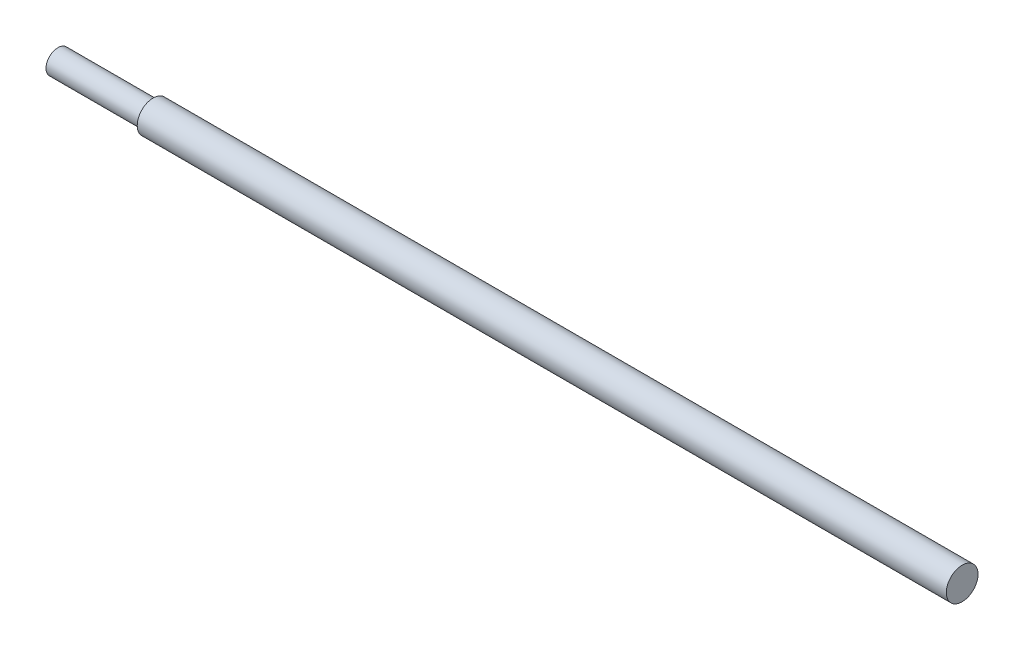
ISO-10303-21;
HEADER;
FILE_DESCRIPTION(('STEP AP214'),'2;1');
FILE_NAME('part.step','',(''),(''),'','','');
FILE_SCHEMA(('AUTOMOTIVE_DESIGN { 1 0 10303 214 1 1 1 1 }'));
ENDSEC;
DATA;
#1=APPLICATION_CONTEXT('core data for automotive mechanical design processes');
#2=APPLICATION_PROTOCOL_DEFINITION('international standard','automotive_design',2000,#1);
#3=PRODUCT_CONTEXT('',#1,'mechanical');
#4=PRODUCT('Part','Part','',(#3));
#5=PRODUCT_RELATED_PRODUCT_CATEGORY('part','',(#4));
#6=PRODUCT_DEFINITION_FORMATION('','',#4);
#7=PRODUCT_DEFINITION_CONTEXT('part definition',#1,'design');
#8=PRODUCT_DEFINITION('design','',#6,#7);
#9=PRODUCT_DEFINITION_SHAPE('','',#8);
#10=(LENGTH_UNIT() NAMED_UNIT(*) SI_UNIT(.MILLI.,.METRE.));
#11=(NAMED_UNIT(*) PLANE_ANGLE_UNIT() SI_UNIT($,.RADIAN.));
#12=(NAMED_UNIT(*) SI_UNIT($,.STERADIAN.) SOLID_ANGLE_UNIT());
#13=UNCERTAINTY_MEASURE_WITH_UNIT(LENGTH_MEASURE(1.E-05),#10,'distance_accuracy_value','');
#14=(GEOMETRIC_REPRESENTATION_CONTEXT(3) GLOBAL_UNCERTAINTY_ASSIGNED_CONTEXT((#13)) GLOBAL_UNIT_ASSIGNED_CONTEXT((#10,
#11,#12)) REPRESENTATION_CONTEXT('',''));
#15=CARTESIAN_POINT('',(0.,0.,0.));
#16=DIRECTION('',(0.,0.,1.));
#17=DIRECTION('',(1.,0.,0.));
#18=AXIS2_PLACEMENT_3D('',#15,#16,#17);
#19=CARTESIAN_POINT('',(1.11022302462518E-13,0.,0.));
#20=DIRECTION('',(1.,0.,0.));
#21=DIRECTION('',(0.,0.,-1.));
#22=AXIS2_PLACEMENT_3D('',#19,#20,#21);
#23=PLANE('',#22);
#24=CARTESIAN_POINT('',(1.11022302462516E-13,0.,0.));
#25=DIRECTION('',(-1.,0.,0.));
#26=DIRECTION('',(0.,0.,1.));
#27=AXIS2_PLACEMENT_3D('',#24,#25,#26);
#28=CIRCLE('',#27,12.7);
#29=CARTESIAN_POINT('',(1.12577603897433E-13,0.,12.6999999999999));
#30=VERTEX_POINT('',#29);
#31=EDGE_CURVE('E71',#30,#30,#28,.T.);
#32=ORIENTED_EDGE('',*,*,#31,.F.);
#33=EDGE_LOOP('',(#32));
#34=FACE_BOUND('',#33,.T.);
#35=ADVANCED_FACE('F39',(#34),#23,.T.);
#36=CARTESIAN_POINT('',(-723.9,0.,0.));
#37=DIRECTION('',(-1.,0.,0.));
#38=DIRECTION('',(0.,0.,1.));
#39=AXIS2_PLACEMENT_3D('',#36,#37,#38);
#40=CYLINDRICAL_SURFACE('',#39,12.7);
#41=CARTESIAN_POINT('',(-424.18,0.,0.));
#42=DIRECTION('',(-1.,0.,0.));
#43=DIRECTION('',(0.,0.,1.));
#44=AXIS2_PLACEMENT_3D('',#41,#42,#43);
#45=CIRCLE('',#44,12.7);
#46=CARTESIAN_POINT('',(-424.18,-8.40026041262992,-9.52500000000016));
#47=VERTEX_POINT('',#46);
#48=CARTESIAN_POINT('',(-424.18,8.40026041262992,-9.52500000000016));
#49=VERTEX_POINT('',#48);
#50=EDGE_CURVE('E66',#47,#49,#45,.F.);
#51=ORIENTED_EDGE('',*,*,#50,.F.);
#52=DIRECTION('',(-1.,0.,0.));
#53=VECTOR('',#52,1.);
#54=CARTESIAN_POINT('',(-723.9,-8.40026041262988,-9.52500000000016));
#55=LINE('',#54,#53);
#56=CARTESIAN_POINT('',(-398.78,-8.40026041262988,-9.52500000000016));
#57=VERTEX_POINT('',#56);
#58=EDGE_CURVE('E11',#57,#47,#55,.T.);
#59=ORIENTED_EDGE('',*,*,#58,.F.);
#60=CARTESIAN_POINT('',(-398.78,0.,0.));
#61=DIRECTION('',(1.,0.,0.));
#62=DIRECTION('',(0.,0.,-1.));
#63=AXIS2_PLACEMENT_3D('',#60,#61,#62);
#64=CIRCLE('',#63,12.7);
#65=CARTESIAN_POINT('',(-398.78,8.40026041262988,-9.52500000000016));
#66=VERTEX_POINT('',#65);
#67=EDGE_CURVE('E46',#66,#57,#64,.F.);
#68=ORIENTED_EDGE('',*,*,#67,.F.);
#69=DIRECTION('',(-1.,0.,0.));
#70=VECTOR('',#69,1.);
#71=CARTESIAN_POINT('',(-723.9,8.40026041262988,-9.52500000000016));
#72=LINE('',#71,#70);
#73=EDGE_CURVE('E53',#49,#66,#72,.F.);
#74=ORIENTED_EDGE('',*,*,#73,.F.);
#75=EDGE_LOOP('',(#51,#59,#68,#74));
#76=FACE_BOUND('',#75,.T.);
#77=ORIENTED_EDGE('',*,*,#31,.T.);
#78=EDGE_LOOP('',(#77));
#79=FACE_BOUND('',#78,.T.);
#80=CARTESIAN_POINT('',(-647.7,0.,0.));
#81=DIRECTION('',(-1.,0.,0.));
#82=DIRECTION('',(0.,0.,1.));
#83=AXIS2_PLACEMENT_3D('',#80,#81,#82);
#84=CIRCLE('',#83,12.7);
#85=CARTESIAN_POINT('',(-647.7,0.,12.7));
#86=VERTEX_POINT('',#85);
#87=EDGE_CURVE('E86',#86,#86,#84,.T.);
#88=ORIENTED_EDGE('',*,*,#87,.F.);
#89=EDGE_LOOP('',(#88));
#90=FACE_BOUND('',#89,.T.);
#91=ADVANCED_FACE('F67',(#76,#79,#90),#40,.T.);
#92=CARTESIAN_POINT('',(-647.7,0.,0.));
#93=DIRECTION('',(-1.,0.,0.));
#94=DIRECTION('',(0.,0.,1.));
#95=AXIS2_PLACEMENT_3D('',#92,#93,#94);
#96=PLANE('',#95);
#97=ORIENTED_EDGE('',*,*,#87,.T.);
#98=EDGE_LOOP('',(#97));
#99=FACE_BOUND('',#98,.T.);
#100=CARTESIAN_POINT('',(-647.7,0.,0.));
#101=DIRECTION('',(-1.,0.,0.));
#102=DIRECTION('',(0.,0.,1.));
#103=AXIS2_PLACEMENT_3D('',#100,#101,#102);
#104=CIRCLE('',#103,9.52499999999999);
#105=CARTESIAN_POINT('',(-647.7,0.,9.52499999999998));
#106=VERTEX_POINT('',#105);
#107=EDGE_CURVE('E83',#106,#106,#104,.T.);
#108=ORIENTED_EDGE('',*,*,#107,.F.);
#109=EDGE_LOOP('',(#108));
#110=FACE_BOUND('',#109,.T.);
#111=ADVANCED_FACE('F98',(#99,#110),#96,.T.);
#112=CARTESIAN_POINT('',(-723.9,0.,0.));
#113=DIRECTION('',(-1.,0.,0.));
#114=DIRECTION('',(0.,0.,1.));
#115=AXIS2_PLACEMENT_3D('',#112,#113,#114);
#116=CYLINDRICAL_SURFACE('',#115,9.525);
#117=ORIENTED_EDGE('',*,*,#107,.T.);
#118=EDGE_LOOP('',(#117));
#119=FACE_BOUND('',#118,.T.);
#120=CARTESIAN_POINT('',(-723.9,0.,0.));
#121=DIRECTION('',(-1.,0.,0.));
#122=DIRECTION('',(0.,0.,1.));
#123=AXIS2_PLACEMENT_3D('',#120,#121,#122);
#124=CIRCLE('',#123,9.525);
#125=CARTESIAN_POINT('',(-723.9,0.,9.525));
#126=VERTEX_POINT('',#125);
#127=EDGE_CURVE('E78',#126,#126,#124,.T.);
#128=ORIENTED_EDGE('',*,*,#127,.F.);
#129=EDGE_LOOP('',(#128));
#130=FACE_BOUND('',#129,.T.);
#131=ADVANCED_FACE('F102',(#119,#130),#116,.T.);
#132=CARTESIAN_POINT('',(-723.9,0.,0.));
#133=DIRECTION('',(-1.,0.,0.));
#134=DIRECTION('',(0.,0.,1.));
#135=AXIS2_PLACEMENT_3D('',#132,#133,#134);
#136=PLANE('',#135);
#137=ORIENTED_EDGE('',*,*,#127,.T.);
#138=EDGE_LOOP('',(#137));
#139=FACE_BOUND('',#138,.T.);
#140=ADVANCED_FACE('F108',(#139),#136,.T.);
#141=CARTESIAN_POINT('',(-398.78,-12.7,-9.52500000000016));
#142=DIRECTION('',(1.,0.,0.));
#143=DIRECTION('',(0.,0.,-1.));
#144=AXIS2_PLACEMENT_3D('',#141,#142,#143);
#145=PLANE('',#144);
#146=ORIENTED_EDGE('',*,*,#67,.T.);
#147=DIRECTION('',(0.,1.,0.));
#148=VECTOR('',#147,1.);
#149=CARTESIAN_POINT('',(-398.78,-12.7,-9.52500000000016));
#150=LINE('',#149,#148);
#151=EDGE_CURVE('E75',#57,#66,#150,.T.);
#152=ORIENTED_EDGE('',*,*,#151,.T.);
#153=EDGE_LOOP('',(#146,#152));
#154=FACE_BOUND('',#153,.T.);
#155=ADVANCED_FACE('F112',(#154),#145,.F.);
#156=CARTESIAN_POINT('',(-424.18,-12.7,-9.52500000000016));
#157=DIRECTION('',(0.,0.,1.));
#158=DIRECTION('',(1.,0.,0.));
#159=AXIS2_PLACEMENT_3D('',#156,#157,#158);
#160=PLANE('',#159);
#161=ORIENTED_EDGE('',*,*,#73,.T.);
#162=ORIENTED_EDGE('',*,*,#151,.F.);
#163=ORIENTED_EDGE('',*,*,#58,.T.);
#164=DIRECTION('',(0.,1.,0.));
#165=VECTOR('',#164,1.);
#166=CARTESIAN_POINT('',(-424.18,-12.7,-9.52500000000016));
#167=LINE('',#166,#165);
#168=EDGE_CURVE('E74',#47,#49,#167,.T.);
#169=ORIENTED_EDGE('',*,*,#168,.T.);
#170=EDGE_LOOP('',(#161,#162,#163,#169));
#171=FACE_BOUND('',#170,.T.);
#172=ADVANCED_FACE('F73',(#171),#160,.F.);
#173=CARTESIAN_POINT('',(-424.18,-12.7,-9.52500000000016));
#174=DIRECTION('',(-1.,0.,0.));
#175=DIRECTION('',(0.,0.,1.));
#176=AXIS2_PLACEMENT_3D('',#173,#174,#175);
#177=PLANE('',#176);
#178=ORIENTED_EDGE('',*,*,#168,.F.);
#179=ORIENTED_EDGE('',*,*,#50,.T.);
#180=EDGE_LOOP('',(#178,#179));
#181=FACE_BOUND('',#180,.T.);
#182=ADVANCED_FACE('F76',(#181),#177,.F.);
#183=CLOSED_SHELL('',(#35,#91,#111,#131,#140,#155,#172,#182));
#184=MANIFOLD_SOLID_BREP('B2',#183);
#185=ADVANCED_BREP_SHAPE_REPRESENTATION('',(#18,#184),#14);
#186=SHAPE_DEFINITION_REPRESENTATION(#9,#185);
ENDSEC;
END-ISO-10303-21;
